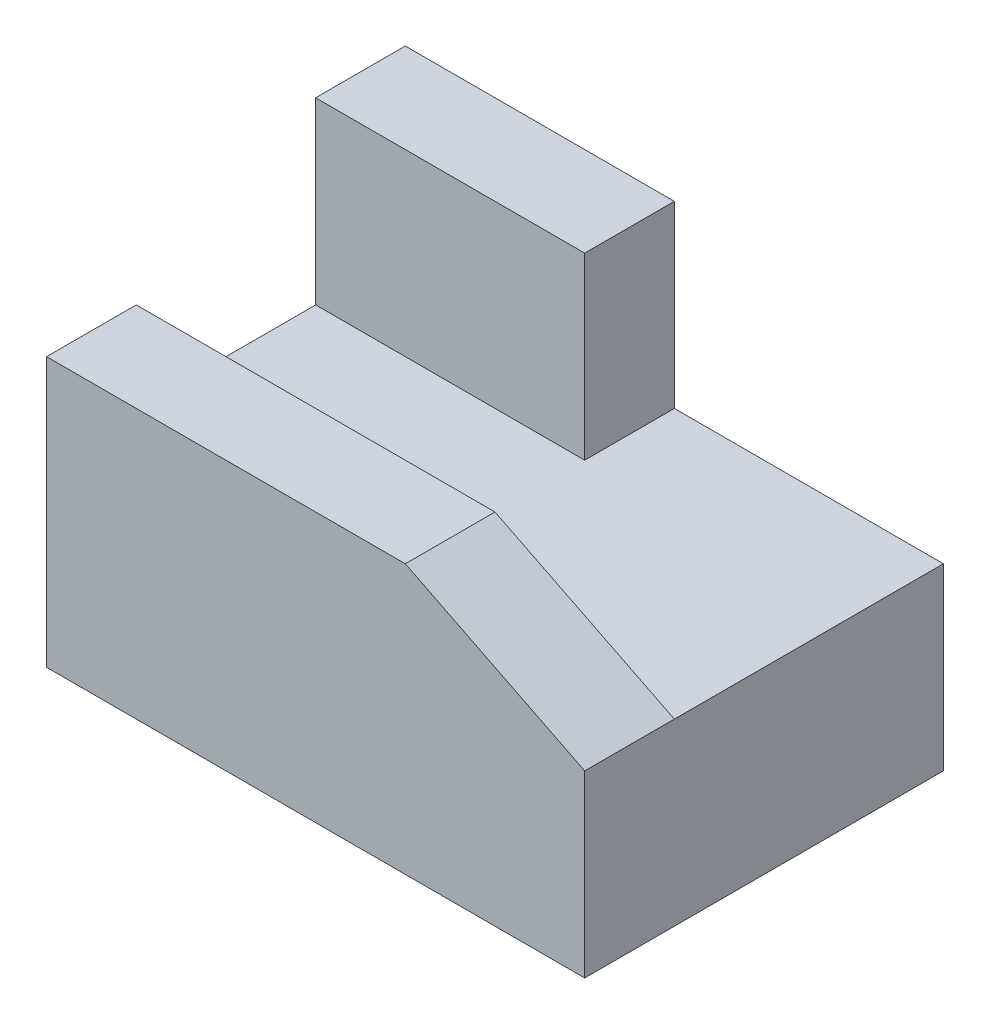
ISO-10303-21;
HEADER;
FILE_DESCRIPTION(('STEP AP214'),'2;1');
FILE_NAME('part.step','',(''),(''),'','','');
FILE_SCHEMA(('AUTOMOTIVE_DESIGN { 1 0 10303 214 1 1 1 1 }'));
ENDSEC;
DATA;
#1=APPLICATION_CONTEXT('core data for automotive mechanical design processes');
#2=APPLICATION_PROTOCOL_DEFINITION('international standard','automotive_design',2000,#1);
#3=PRODUCT_CONTEXT('',#1,'mechanical');
#4=PRODUCT('Part','Part','',(#3));
#5=PRODUCT_RELATED_PRODUCT_CATEGORY('part','',(#4));
#6=PRODUCT_DEFINITION_FORMATION('','',#4);
#7=PRODUCT_DEFINITION_CONTEXT('part definition',#1,'design');
#8=PRODUCT_DEFINITION('design','',#6,#7);
#9=PRODUCT_DEFINITION_SHAPE('','',#8);
#10=(LENGTH_UNIT() NAMED_UNIT(*) SI_UNIT(.MILLI.,.METRE.));
#11=(NAMED_UNIT(*) PLANE_ANGLE_UNIT() SI_UNIT($,.RADIAN.));
#12=(NAMED_UNIT(*) SI_UNIT($,.STERADIAN.) SOLID_ANGLE_UNIT());
#13=UNCERTAINTY_MEASURE_WITH_UNIT(LENGTH_MEASURE(1.E-05),#10,'distance_accuracy_value','');
#14=(GEOMETRIC_REPRESENTATION_CONTEXT(3) GLOBAL_UNCERTAINTY_ASSIGNED_CONTEXT((#13)) GLOBAL_UNIT_ASSIGNED_CONTEXT((#10,
#11,#12)) REPRESENTATION_CONTEXT('',''));
#15=CARTESIAN_POINT('',(0.,0.,0.));
#16=DIRECTION('',(0.,0.,1.));
#17=DIRECTION('',(1.,0.,0.));
#18=AXIS2_PLACEMENT_3D('',#15,#16,#17);
#19=CARTESIAN_POINT('',(0.,10.,10.));
#20=DIRECTION('',(0.,0.,1.));
#21=DIRECTION('',(1.,0.,0.));
#22=AXIS2_PLACEMENT_3D('',#19,#20,#21);
#23=PLANE('',#22);
#24=DIRECTION('',(0.894427190999916,-0.447213595499958,0.));
#25=VECTOR('',#24,1.);
#26=CARTESIAN_POINT('',(5.,15.,10.));
#27=LINE('',#26,#25);
#28=CARTESIAN_POINT('',(5.,15.,10.));
#29=VERTEX_POINT('',#28);
#30=CARTESIAN_POINT('',(15.,10.,10.));
#31=VERTEX_POINT('',#30);
#32=EDGE_CURVE('E111',#29,#31,#27,.T.);
#33=ORIENTED_EDGE('',*,*,#32,.F.);
#34=DIRECTION('',(-1.,0.,0.));
#35=VECTOR('',#34,1.);
#36=CARTESIAN_POINT('',(0.,15.,10.));
#37=LINE('',#36,#35);
#38=CARTESIAN_POINT('',(-15.,15.,10.));
#39=VERTEX_POINT('',#38);
#40=EDGE_CURVE('E120',#29,#39,#37,.T.);
#41=ORIENTED_EDGE('',*,*,#40,.T.);
#42=DIRECTION('',(0.,-1.,0.));
#43=VECTOR('',#42,1.);
#44=CARTESIAN_POINT('',(-15.,10.,10.));
#45=LINE('',#44,#43);
#46=CARTESIAN_POINT('',(-15.,0.,10.));
#47=VERTEX_POINT('',#46);
#48=EDGE_CURVE('E154',#39,#47,#45,.T.);
#49=ORIENTED_EDGE('',*,*,#48,.T.);
#50=DIRECTION('',(-1.,0.,0.));
#51=VECTOR('',#50,1.);
#52=CARTESIAN_POINT('',(0.,0.,10.));
#53=LINE('',#52,#51);
#54=CARTESIAN_POINT('',(15.,0.,10.));
#55=VERTEX_POINT('',#54);
#56=EDGE_CURVE('E144',#55,#47,#53,.T.);
#57=ORIENTED_EDGE('',*,*,#56,.F.);
#58=DIRECTION('',(0.,-1.,0.));
#59=VECTOR('',#58,1.);
#60=CARTESIAN_POINT('',(15.,10.,10.));
#61=LINE('',#60,#59);
#62=EDGE_CURVE('E46',#31,#55,#61,.T.);
#63=ORIENTED_EDGE('',*,*,#62,.F.);
#64=EDGE_LOOP('',(#33,#41,#49,#57,#63));
#65=FACE_BOUND('',#64,.T.);
#66=ADVANCED_FACE('F39',(#65),#23,.T.);
#67=CARTESIAN_POINT('',(15.,10.,0.));
#68=DIRECTION('',(1.,0.,0.));
#69=DIRECTION('',(0.,0.,-1.));
#70=AXIS2_PLACEMENT_3D('',#67,#68,#69);
#71=PLANE('',#70);
#72=DIRECTION('',(0.,0.,1.));
#73=VECTOR('',#72,1.);
#74=CARTESIAN_POINT('',(15.,10.,-10.));
#75=LINE('',#74,#73);
#76=CARTESIAN_POINT('',(15.,10.,5.));
#77=VERTEX_POINT('',#76);
#78=EDGE_CURVE('E123',#77,#31,#75,.T.);
#79=ORIENTED_EDGE('',*,*,#78,.T.);
#80=ORIENTED_EDGE('',*,*,#62,.T.);
#81=DIRECTION('',(0.,0.,1.));
#82=VECTOR('',#81,1.);
#83=CARTESIAN_POINT('',(15.,0.,0.));
#84=LINE('',#83,#82);
#85=CARTESIAN_POINT('',(15.,0.,-10.));
#86=VERTEX_POINT('',#85);
#87=EDGE_CURVE('E157',#86,#55,#84,.T.);
#88=ORIENTED_EDGE('',*,*,#87,.F.);
#89=DIRECTION('',(0.,-1.,0.));
#90=VECTOR('',#89,1.);
#91=CARTESIAN_POINT('',(15.,10.,-10.));
#92=LINE('',#91,#90);
#93=CARTESIAN_POINT('',(15.,10.,-10.));
#94=VERTEX_POINT('',#93);
#95=EDGE_CURVE('E167',#94,#86,#92,.T.);
#96=ORIENTED_EDGE('',*,*,#95,.F.);
#97=DIRECTION('',(0.,0.,1.));
#98=VECTOR('',#97,1.);
#99=CARTESIAN_POINT('',(15.,10.,0.));
#100=LINE('',#99,#98);
#101=EDGE_CURVE('E145',#94,#77,#100,.T.);
#102=ORIENTED_EDGE('',*,*,#101,.T.);
#103=EDGE_LOOP('',(#79,#80,#88,#96,#102));
#104=FACE_BOUND('',#103,.T.);
#105=ADVANCED_FACE('F170',(#104),#71,.T.);
#106=CARTESIAN_POINT('',(0.,10.,-10.));
#107=DIRECTION('',(0.,0.,1.));
#108=DIRECTION('',(1.,0.,0.));
#109=AXIS2_PLACEMENT_3D('',#106,#107,#108);
#110=PLANE('',#109);
#111=DIRECTION('',(-1.,0.,0.));
#112=VECTOR('',#111,1.);
#113=CARTESIAN_POINT('',(0.,0.,-10.));
#114=LINE('',#113,#112);
#115=CARTESIAN_POINT('',(-15.,0.,-10.));
#116=VERTEX_POINT('',#115);
#117=EDGE_CURVE('E160',#86,#116,#114,.T.);
#118=ORIENTED_EDGE('',*,*,#117,.T.);
#119=DIRECTION('',(0.,-1.,0.));
#120=VECTOR('',#119,1.);
#121=CARTESIAN_POINT('',(-15.,10.,-10.));
#122=LINE('',#121,#120);
#123=CARTESIAN_POINT('',(-15.,20.,-10.));
#124=VERTEX_POINT('',#123);
#125=EDGE_CURVE('E164',#124,#116,#122,.T.);
#126=ORIENTED_EDGE('',*,*,#125,.F.);
#127=DIRECTION('',(-1.,0.,0.));
#128=VECTOR('',#127,1.);
#129=CARTESIAN_POINT('',(0.,20.,-10.));
#130=LINE('',#129,#128);
#131=CARTESIAN_POINT('',(0.,20.,-10.));
#132=VERTEX_POINT('',#131);
#133=EDGE_CURVE('E184',#132,#124,#130,.T.);
#134=ORIENTED_EDGE('',*,*,#133,.F.);
#135=DIRECTION('',(0.,-1.,0.));
#136=VECTOR('',#135,1.);
#137=CARTESIAN_POINT('',(0.,20.,-10.));
#138=LINE('',#137,#136);
#139=CARTESIAN_POINT('',(0.,10.,-10.));
#140=VERTEX_POINT('',#139);
#141=EDGE_CURVE('E201',#132,#140,#138,.T.);
#142=ORIENTED_EDGE('',*,*,#141,.T.);
#143=DIRECTION('',(-1.,0.,0.));
#144=VECTOR('',#143,1.);
#145=CARTESIAN_POINT('',(0.,10.,-10.));
#146=LINE('',#145,#144);
#147=EDGE_CURVE('E148',#94,#140,#146,.T.);
#148=ORIENTED_EDGE('',*,*,#147,.F.);
#149=ORIENTED_EDGE('',*,*,#95,.T.);
#150=EDGE_LOOP('',(#118,#126,#134,#142,#148,#149));
#151=FACE_BOUND('',#150,.T.);
#152=ADVANCED_FACE('F182',(#151),#110,.F.);
#153=CARTESIAN_POINT('',(-15.,10.,0.));
#154=DIRECTION('',(1.,0.,0.));
#155=DIRECTION('',(0.,0.,-1.));
#156=AXIS2_PLACEMENT_3D('',#153,#154,#155);
#157=PLANE('',#156);
#158=DIRECTION('',(0.,0.,1.));
#159=VECTOR('',#158,1.);
#160=CARTESIAN_POINT('',(-15.,0.,0.));
#161=LINE('',#160,#159);
#162=EDGE_CURVE('E149',#116,#47,#161,.T.);
#163=ORIENTED_EDGE('',*,*,#162,.T.);
#164=ORIENTED_EDGE('',*,*,#48,.F.);
#165=DIRECTION('',(0.,0.,1.));
#166=VECTOR('',#165,1.);
#167=CARTESIAN_POINT('',(-15.,15.,0.));
#168=LINE('',#167,#166);
#169=CARTESIAN_POINT('',(-15.,15.,5.));
#170=VERTEX_POINT('',#169);
#171=EDGE_CURVE('E128',#170,#39,#168,.T.);
#172=ORIENTED_EDGE('',*,*,#171,.F.);
#173=DIRECTION('',(0.,-1.,0.));
#174=VECTOR('',#173,1.);
#175=CARTESIAN_POINT('',(-15.,15.,5.));
#176=LINE('',#175,#174);
#177=CARTESIAN_POINT('',(-15.,10.,5.));
#178=VERTEX_POINT('',#177);
#179=EDGE_CURVE('E138',#170,#178,#176,.T.);
#180=ORIENTED_EDGE('',*,*,#179,.T.);
#181=DIRECTION('',(0.,0.,1.));
#182=VECTOR('',#181,1.);
#183=CARTESIAN_POINT('',(-15.,10.,0.));
#184=LINE('',#183,#182);
#185=CARTESIAN_POINT('',(-15.,10.,-5.));
#186=VERTEX_POINT('',#185);
#187=EDGE_CURVE('E152',#186,#178,#184,.T.);
#188=ORIENTED_EDGE('',*,*,#187,.F.);
#189=DIRECTION('',(0.,-1.,0.));
#190=VECTOR('',#189,1.);
#191=CARTESIAN_POINT('',(-15.,20.,-5.));
#192=LINE('',#191,#190);
#193=CARTESIAN_POINT('',(-15.,20.,-5.));
#194=VERTEX_POINT('',#193);
#195=EDGE_CURVE('E60',#194,#186,#192,.T.);
#196=ORIENTED_EDGE('',*,*,#195,.F.);
#197=DIRECTION('',(0.,0.,1.));
#198=VECTOR('',#197,1.);
#199=CARTESIAN_POINT('',(-15.,20.,0.));
#200=LINE('',#199,#198);
#201=EDGE_CURVE('E178',#124,#194,#200,.T.);
#202=ORIENTED_EDGE('',*,*,#201,.F.);
#203=ORIENTED_EDGE('',*,*,#125,.T.);
#204=EDGE_LOOP('',(#163,#164,#172,#180,#188,#196,#202,#203));
#205=FACE_BOUND('',#204,.T.);
#206=ADVANCED_FACE('F176',(#205),#157,.F.);
#207=CARTESIAN_POINT('',(0.,10.,0.));
#208=DIRECTION('',(0.,1.,0.));
#209=DIRECTION('',(0.,0.,1.));
#210=AXIS2_PLACEMENT_3D('',#207,#208,#209);
#211=PLANE('',#210);
#212=DIRECTION('',(0.,0.,-1.));
#213=VECTOR('',#212,1.);
#214=CARTESIAN_POINT('',(0.,10.,0.));
#215=LINE('',#214,#213);
#216=CARTESIAN_POINT('',(0.,10.,-5.));
#217=VERTEX_POINT('',#216);
#218=EDGE_CURVE('E130',#217,#140,#215,.T.);
#219=ORIENTED_EDGE('',*,*,#218,.F.);
#220=DIRECTION('',(-1.,0.,0.));
#221=VECTOR('',#220,1.);
#222=CARTESIAN_POINT('',(0.,10.,-5.));
#223=LINE('',#222,#221);
#224=EDGE_CURVE('E133',#217,#186,#223,.T.);
#225=ORIENTED_EDGE('',*,*,#224,.T.);
#226=ORIENTED_EDGE('',*,*,#187,.T.);
#227=DIRECTION('',(-1.,0.,0.));
#228=VECTOR('',#227,1.);
#229=CARTESIAN_POINT('',(0.,10.,5.));
#230=LINE('',#229,#228);
#231=EDGE_CURVE('E141',#77,#178,#230,.T.);
#232=ORIENTED_EDGE('',*,*,#231,.F.);
#233=ORIENTED_EDGE('',*,*,#101,.F.);
#234=ORIENTED_EDGE('',*,*,#147,.T.);
#235=EDGE_LOOP('',(#219,#225,#226,#232,#233,#234));
#236=FACE_BOUND('',#235,.T.);
#237=ADVANCED_FACE('F205',(#236),#211,.T.);
#238=CARTESIAN_POINT('',(0.,0.,0.));
#239=DIRECTION('',(0.,1.,0.));
#240=DIRECTION('',(0.,0.,1.));
#241=AXIS2_PLACEMENT_3D('',#238,#239,#240);
#242=PLANE('',#241);
#243=ORIENTED_EDGE('',*,*,#162,.F.);
#244=ORIENTED_EDGE('',*,*,#117,.F.);
#245=ORIENTED_EDGE('',*,*,#87,.T.);
#246=ORIENTED_EDGE('',*,*,#56,.T.);
#247=EDGE_LOOP('',(#243,#244,#245,#246));
#248=FACE_BOUND('',#247,.T.);
#249=ADVANCED_FACE('F174',(#248),#242,.F.);
#250=CARTESIAN_POINT('',(0.,15.,5.));
#251=DIRECTION('',(0.,0.,-1.));
#252=DIRECTION('',(-1.,0.,0.));
#253=AXIS2_PLACEMENT_3D('',#250,#251,#252);
#254=PLANE('',#253);
#255=DIRECTION('',(-0.894427190999916,0.447213595499958,0.));
#256=VECTOR('',#255,1.);
#257=CARTESIAN_POINT('',(1.,17.,5.));
#258=LINE('',#257,#256);
#259=CARTESIAN_POINT('',(5.,15.,5.));
#260=VERTEX_POINT('',#259);
#261=EDGE_CURVE('E52',#77,#260,#258,.T.);
#262=ORIENTED_EDGE('',*,*,#261,.F.);
#263=ORIENTED_EDGE('',*,*,#231,.T.);
#264=ORIENTED_EDGE('',*,*,#179,.F.);
#265=DIRECTION('',(1.,0.,0.));
#266=VECTOR('',#265,1.);
#267=CARTESIAN_POINT('',(0.,15.,5.));
#268=LINE('',#267,#266);
#269=EDGE_CURVE('E129',#170,#260,#268,.T.);
#270=ORIENTED_EDGE('',*,*,#269,.T.);
#271=EDGE_LOOP('',(#262,#263,#264,#270));
#272=FACE_BOUND('',#271,.T.);
#273=ADVANCED_FACE('F209',(#272),#254,.T.);
#274=CARTESIAN_POINT('',(0.,15.,0.));
#275=DIRECTION('',(0.,1.,0.));
#276=DIRECTION('',(0.,0.,1.));
#277=AXIS2_PLACEMENT_3D('',#274,#275,#276);
#278=PLANE('',#277);
#279=DIRECTION('',(0.,0.,1.));
#280=VECTOR('',#279,1.);
#281=CARTESIAN_POINT('',(5.,15.,0.));
#282=LINE('',#281,#280);
#283=EDGE_CURVE('E11',#260,#29,#282,.T.);
#284=ORIENTED_EDGE('',*,*,#283,.F.);
#285=ORIENTED_EDGE('',*,*,#269,.F.);
#286=ORIENTED_EDGE('',*,*,#171,.T.);
#287=ORIENTED_EDGE('',*,*,#40,.F.);
#288=EDGE_LOOP('',(#284,#285,#286,#287));
#289=FACE_BOUND('',#288,.T.);
#290=ADVANCED_FACE('F126',(#289),#278,.T.);
#291=CARTESIAN_POINT('',(0.,20.,0.));
#292=DIRECTION('',(1.,0.,0.));
#293=DIRECTION('',(0.,0.,-1.));
#294=AXIS2_PLACEMENT_3D('',#291,#292,#293);
#295=PLANE('',#294);
#296=DIRECTION('',(0.,-1.,0.));
#297=VECTOR('',#296,1.);
#298=CARTESIAN_POINT('',(0.,20.,-5.));
#299=LINE('',#298,#297);
#300=CARTESIAN_POINT('',(0.,20.,-5.));
#301=VERTEX_POINT('',#300);
#302=EDGE_CURVE('E197',#301,#217,#299,.T.);
#303=ORIENTED_EDGE('',*,*,#302,.T.);
#304=ORIENTED_EDGE('',*,*,#218,.T.);
#305=ORIENTED_EDGE('',*,*,#141,.F.);
#306=DIRECTION('',(0.,0.,1.));
#307=VECTOR('',#306,1.);
#308=CARTESIAN_POINT('',(0.,20.,0.));
#309=LINE('',#308,#307);
#310=EDGE_CURVE('E189',#132,#301,#309,.T.);
#311=ORIENTED_EDGE('',*,*,#310,.T.);
#312=EDGE_LOOP('',(#303,#304,#305,#311));
#313=FACE_BOUND('',#312,.T.);
#314=ADVANCED_FACE('F213',(#313),#295,.T.);
#315=CARTESIAN_POINT('',(0.,20.,-5.));
#316=DIRECTION('',(0.,0.,-1.));
#317=DIRECTION('',(-1.,0.,0.));
#318=AXIS2_PLACEMENT_3D('',#315,#316,#317);
#319=PLANE('',#318);
#320=ORIENTED_EDGE('',*,*,#224,.F.);
#321=ORIENTED_EDGE('',*,*,#302,.F.);
#322=DIRECTION('',(1.,0.,0.));
#323=VECTOR('',#322,1.);
#324=CARTESIAN_POINT('',(0.,20.,-5.));
#325=LINE('',#324,#323);
#326=EDGE_CURVE('E191',#194,#301,#325,.T.);
#327=ORIENTED_EDGE('',*,*,#326,.F.);
#328=ORIENTED_EDGE('',*,*,#195,.T.);
#329=EDGE_LOOP('',(#320,#321,#327,#328));
#330=FACE_BOUND('',#329,.T.);
#331=ADVANCED_FACE('F214',(#330),#319,.F.);
#332=CARTESIAN_POINT('',(0.,20.,0.));
#333=DIRECTION('',(0.,1.,0.));
#334=DIRECTION('',(0.,0.,1.));
#335=AXIS2_PLACEMENT_3D('',#332,#333,#334);
#336=PLANE('',#335);
#337=ORIENTED_EDGE('',*,*,#310,.F.);
#338=ORIENTED_EDGE('',*,*,#133,.T.);
#339=ORIENTED_EDGE('',*,*,#201,.T.);
#340=ORIENTED_EDGE('',*,*,#326,.T.);
#341=EDGE_LOOP('',(#337,#338,#339,#340));
#342=FACE_BOUND('',#341,.T.);
#343=ADVANCED_FACE('F187',(#342),#336,.T.);
#344=CARTESIAN_POINT('',(5.,15.,-10.));
#345=DIRECTION('',(-0.447213595499958,-0.894427190999916,0.));
#346=DIRECTION('',(0.894427190999916,-0.447213595499958,0.));
#347=AXIS2_PLACEMENT_3D('',#344,#345,#346);
#348=PLANE('',#347);
#349=ORIENTED_EDGE('',*,*,#261,.T.);
#350=ORIENTED_EDGE('',*,*,#283,.T.);
#351=ORIENTED_EDGE('',*,*,#32,.T.);
#352=ORIENTED_EDGE('',*,*,#78,.F.);
#353=EDGE_LOOP('',(#349,#350,#351,#352));
#354=FACE_BOUND('',#353,.T.);
#355=ADVANCED_FACE('F110',(#354),#348,.F.);
#356=CLOSED_SHELL('',(#66,#105,#152,#206,#237,#249,#273,#290,#314,#331,#343,#355));
#357=MANIFOLD_SOLID_BREP('B2',#356);
#358=ADVANCED_BREP_SHAPE_REPRESENTATION('',(#18,#357),#14);
#359=SHAPE_DEFINITION_REPRESENTATION(#9,#358);
ENDSEC;
END-ISO-10303-21;
